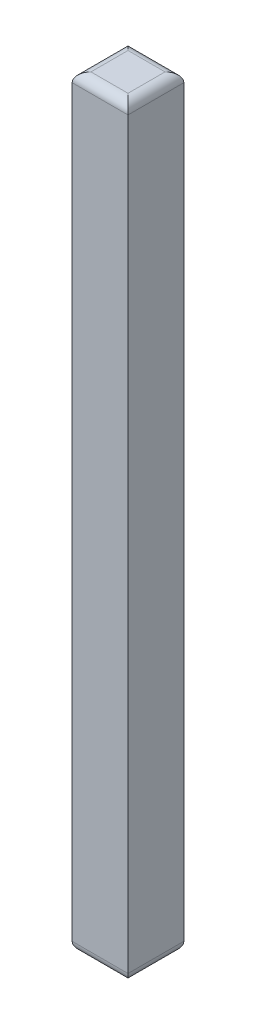
ISO-10303-21;
HEADER;
FILE_DESCRIPTION(('STEP AP214'),'2;1');
FILE_NAME('part.step','',(''),(''),'','','');
FILE_SCHEMA(('AUTOMOTIVE_DESIGN { 1 0 10303 214 1 1 1 1 }'));
ENDSEC;
DATA;
#1=APPLICATION_CONTEXT('core data for automotive mechanical design processes');
#2=APPLICATION_PROTOCOL_DEFINITION('international standard','automotive_design',2000,#1);
#3=PRODUCT_CONTEXT('',#1,'mechanical');
#4=PRODUCT('Part','Part','',(#3));
#5=PRODUCT_RELATED_PRODUCT_CATEGORY('part','',(#4));
#6=PRODUCT_DEFINITION_FORMATION('','',#4);
#7=PRODUCT_DEFINITION_CONTEXT('part definition',#1,'design');
#8=PRODUCT_DEFINITION('design','',#6,#7);
#9=PRODUCT_DEFINITION_SHAPE('','',#8);
#10=(LENGTH_UNIT() NAMED_UNIT(*) SI_UNIT(.MILLI.,.METRE.));
#11=(NAMED_UNIT(*) PLANE_ANGLE_UNIT() SI_UNIT($,.RADIAN.));
#12=(NAMED_UNIT(*) SI_UNIT($,.STERADIAN.) SOLID_ANGLE_UNIT());
#13=UNCERTAINTY_MEASURE_WITH_UNIT(LENGTH_MEASURE(1.E-05),#10,'distance_accuracy_value','');
#14=(GEOMETRIC_REPRESENTATION_CONTEXT(3) GLOBAL_UNCERTAINTY_ASSIGNED_CONTEXT((#13)) GLOBAL_UNIT_ASSIGNED_CONTEXT((#10,
#11,#12)) REPRESENTATION_CONTEXT('',''));
#15=CARTESIAN_POINT('',(0.,0.,0.));
#16=DIRECTION('',(0.,0.,1.));
#17=DIRECTION('',(1.,0.,0.));
#18=AXIS2_PLACEMENT_3D('',#15,#16,#17);
#19=CARTESIAN_POINT('',(0.,41.275,0.));
#20=DIRECTION('',(1.,0.,0.));
#21=DIRECTION('',(0.,0.,-1.));
#22=AXIS2_PLACEMENT_3D('',#19,#20,#21);
#23=PLANE('',#22);
#24=DIRECTION('',(0.,-1.,0.));
#25=VECTOR('',#24,1.);
#26=CARTESIAN_POINT('',(0.,41.275,0.));
#27=LINE('',#26,#25);
#28=CARTESIAN_POINT('',(0.,40.767,0.));
#29=VERTEX_POINT('',#28);
#30=CARTESIAN_POINT('',(0.,0.508000000000002,0.));
#31=VERTEX_POINT('',#30);
#32=EDGE_CURVE('E118',#29,#31,#27,.T.);
#33=ORIENTED_EDGE('',*,*,#32,.F.);
#34=DIRECTION('',(0.,0.,1.));
#35=VECTOR('',#34,1.);
#36=CARTESIAN_POINT('',(0.,40.767,0.));
#37=LINE('',#36,#35);
#38=CARTESIAN_POINT('',(0.,40.767,-3.0226));
#39=VERTEX_POINT('',#38);
#40=EDGE_CURVE('E142',#29,#39,#37,.F.);
#41=ORIENTED_EDGE('',*,*,#40,.T.);
#42=DIRECTION('',(0.,-1.,0.));
#43=VECTOR('',#42,1.);
#44=CARTESIAN_POINT('',(0.,41.275,-3.0226));
#45=LINE('',#44,#43);
#46=CARTESIAN_POINT('',(0.,0.508000000000002,-3.0226));
#47=VERTEX_POINT('',#46);
#48=EDGE_CURVE('E153',#39,#47,#45,.T.);
#49=ORIENTED_EDGE('',*,*,#48,.T.);
#50=DIRECTION('',(0.,0.,1.));
#51=VECTOR('',#50,1.);
#52=CARTESIAN_POINT('',(0.,0.508000000000002,0.));
#53=LINE('',#52,#51);
#54=EDGE_CURVE('E140',#47,#31,#53,.T.);
#55=ORIENTED_EDGE('',*,*,#54,.T.);
#56=EDGE_LOOP('',(#33,#41,#49,#55));
#57=FACE_BOUND('',#56,.T.);
#58=ADVANCED_FACE('F33',(#57),#23,.F.);
#59=CARTESIAN_POINT('',(0.,41.275,0.));
#60=DIRECTION('',(0.,0.,-1.));
#61=DIRECTION('',(-1.,0.,0.));
#62=AXIS2_PLACEMENT_3D('',#59,#60,#61);
#63=PLANE('',#62);
#64=DIRECTION('',(0.,-1.,0.));
#65=VECTOR('',#64,1.);
#66=CARTESIAN_POINT('',(3.0226,41.275,0.));
#67=LINE('',#66,#65);
#68=CARTESIAN_POINT('',(3.0226,40.767,0.));
#69=VERTEX_POINT('',#68);
#70=CARTESIAN_POINT('',(3.0226,0.508000000000002,0.));
#71=VERTEX_POINT('',#70);
#72=EDGE_CURVE('E278',#69,#71,#67,.T.);
#73=ORIENTED_EDGE('',*,*,#72,.F.);
#74=DIRECTION('',(1.,0.,0.));
#75=VECTOR('',#74,1.);
#76=CARTESIAN_POINT('',(0.,40.767,0.));
#77=LINE('',#76,#75);
#78=EDGE_CURVE('E138',#69,#29,#77,.F.);
#79=ORIENTED_EDGE('',*,*,#78,.T.);
#80=ORIENTED_EDGE('',*,*,#32,.T.);
#81=DIRECTION('',(1.,0.,0.));
#82=VECTOR('',#81,1.);
#83=CARTESIAN_POINT('',(3.0226,0.508000000000002,0.));
#84=LINE('',#83,#82);
#85=EDGE_CURVE('E135',#31,#71,#84,.T.);
#86=ORIENTED_EDGE('',*,*,#85,.T.);
#87=EDGE_LOOP('',(#73,#79,#80,#86));
#88=FACE_BOUND('',#87,.T.);
#89=ADVANCED_FACE('F191',(#88),#63,.F.);
#90=CARTESIAN_POINT('',(3.0226,41.275,0.));
#91=DIRECTION('',(-1.,0.,0.));
#92=DIRECTION('',(0.,0.,1.));
#93=AXIS2_PLACEMENT_3D('',#90,#91,#92);
#94=PLANE('',#93);
#95=DIRECTION('',(0.,-1.,0.));
#96=VECTOR('',#95,1.);
#97=CARTESIAN_POINT('',(3.0226,41.275,-3.0226));
#98=LINE('',#97,#96);
#99=CARTESIAN_POINT('',(3.0226,40.767,-3.0226));
#100=VERTEX_POINT('',#99);
#101=CARTESIAN_POINT('',(3.0226,0.508000000000002,-3.0226));
#102=VERTEX_POINT('',#101);
#103=EDGE_CURVE('E274',#100,#102,#98,.T.);
#104=ORIENTED_EDGE('',*,*,#103,.F.);
#105=DIRECTION('',(0.,0.,-1.));
#106=VECTOR('',#105,1.);
#107=CARTESIAN_POINT('',(3.0226,40.767,0.));
#108=LINE('',#107,#106);
#109=EDGE_CURVE('E133',#100,#69,#108,.F.);
#110=ORIENTED_EDGE('',*,*,#109,.T.);
#111=ORIENTED_EDGE('',*,*,#72,.T.);
#112=DIRECTION('',(0.,0.,-1.));
#113=VECTOR('',#112,1.);
#114=CARTESIAN_POINT('',(3.0226,0.508000000000002,-3.0226));
#115=LINE('',#114,#113);
#116=EDGE_CURVE('E131',#71,#102,#115,.T.);
#117=ORIENTED_EDGE('',*,*,#116,.T.);
#118=EDGE_LOOP('',(#104,#110,#111,#117));
#119=FACE_BOUND('',#118,.T.);
#120=ADVANCED_FACE('F197',(#119),#94,.F.);
#121=CARTESIAN_POINT('',(0.,41.275,-3.0226));
#122=DIRECTION('',(0.,0.,1.));
#123=DIRECTION('',(1.,0.,0.));
#124=AXIS2_PLACEMENT_3D('',#121,#122,#123);
#125=PLANE('',#124);
#126=ORIENTED_EDGE('',*,*,#48,.F.);
#127=DIRECTION('',(-1.,0.,0.));
#128=VECTOR('',#127,1.);
#129=CARTESIAN_POINT('',(0.,40.767,-3.0226));
#130=LINE('',#129,#128);
#131=EDGE_CURVE('E105',#39,#100,#130,.F.);
#132=ORIENTED_EDGE('',*,*,#131,.T.);
#133=ORIENTED_EDGE('',*,*,#103,.T.);
#134=DIRECTION('',(-1.,0.,0.));
#135=VECTOR('',#134,1.);
#136=CARTESIAN_POINT('',(0.,0.508000000000002,-3.0226));
#137=LINE('',#136,#135);
#138=EDGE_CURVE('E124',#102,#47,#137,.T.);
#139=ORIENTED_EDGE('',*,*,#138,.T.);
#140=EDGE_LOOP('',(#126,#132,#133,#139));
#141=FACE_BOUND('',#140,.T.);
#142=ADVANCED_FACE('F187',(#141),#125,.F.);
#143=CARTESIAN_POINT('',(0.,41.275,0.));
#144=DIRECTION('',(0.,-1.,0.));
#145=DIRECTION('',(0.,0.,-1.));
#146=AXIS2_PLACEMENT_3D('',#143,#144,#145);
#147=PLANE('',#146);
#148=DIRECTION('',(0.,0.,-1.));
#149=VECTOR('',#148,1.);
#150=CARTESIAN_POINT('',(2.5146,41.275,0.));
#151=LINE('',#150,#149);
#152=CARTESIAN_POINT('',(2.5146,41.275,-0.508));
#153=VERTEX_POINT('',#152);
#154=CARTESIAN_POINT('',(2.5146,41.275,-2.5146));
#155=VERTEX_POINT('',#154);
#156=EDGE_CURVE('E122',#153,#155,#151,.T.);
#157=ORIENTED_EDGE('',*,*,#156,.T.);
#158=DIRECTION('',(-1.,0.,0.));
#159=VECTOR('',#158,1.);
#160=CARTESIAN_POINT('',(0.,41.275,-2.5146));
#161=LINE('',#160,#159);
#162=CARTESIAN_POINT('',(0.508,41.275,-2.5146));
#163=VERTEX_POINT('',#162);
#164=EDGE_CURVE('E103',#155,#163,#161,.T.);
#165=ORIENTED_EDGE('',*,*,#164,.T.);
#166=DIRECTION('',(0.,0.,1.));
#167=VECTOR('',#166,1.);
#168=CARTESIAN_POINT('',(0.508,41.275,0.));
#169=LINE('',#168,#167);
#170=CARTESIAN_POINT('',(0.508,41.275,-0.508));
#171=VERTEX_POINT('',#170);
#172=EDGE_CURVE('E111',#163,#171,#169,.T.);
#173=ORIENTED_EDGE('',*,*,#172,.T.);
#174=DIRECTION('',(1.,0.,0.));
#175=VECTOR('',#174,1.);
#176=CARTESIAN_POINT('',(0.,41.275,-0.508));
#177=LINE('',#176,#175);
#178=EDGE_CURVE('E117',#171,#153,#177,.T.);
#179=ORIENTED_EDGE('',*,*,#178,.T.);
#180=EDGE_LOOP('',(#157,#165,#173,#179));
#181=FACE_BOUND('',#180,.T.);
#182=ADVANCED_FACE('F120',(#181),#147,.F.);
#183=CARTESIAN_POINT('',(0.,0.,0.));
#184=DIRECTION('',(0.,-1.,0.));
#185=DIRECTION('',(0.,0.,-1.));
#186=AXIS2_PLACEMENT_3D('',#183,#184,#185);
#187=PLANE('',#186);
#188=DIRECTION('',(0.,0.,-1.));
#189=VECTOR('',#188,1.);
#190=CARTESIAN_POINT('',(2.5146,0.,0.));
#191=LINE('',#190,#189);
#192=CARTESIAN_POINT('',(2.5146,0.,-2.5146));
#193=VERTEX_POINT('',#192);
#194=CARTESIAN_POINT('',(2.5146,0.,-0.508));
#195=VERTEX_POINT('',#194);
#196=EDGE_CURVE('E42',#193,#195,#191,.F.);
#197=ORIENTED_EDGE('',*,*,#196,.T.);
#198=DIRECTION('',(1.,0.,0.));
#199=VECTOR('',#198,1.);
#200=CARTESIAN_POINT('',(0.,0.,-0.508));
#201=LINE('',#200,#199);
#202=CARTESIAN_POINT('',(0.508,0.,-0.508));
#203=VERTEX_POINT('',#202);
#204=EDGE_CURVE('E11',#195,#203,#201,.F.);
#205=ORIENTED_EDGE('',*,*,#204,.T.);
#206=DIRECTION('',(0.,0.,1.));
#207=VECTOR('',#206,1.);
#208=CARTESIAN_POINT('',(0.508,0.,-3.0226));
#209=LINE('',#208,#207);
#210=CARTESIAN_POINT('',(0.508,0.,-2.5146));
#211=VERTEX_POINT('',#210);
#212=EDGE_CURVE('E144',#203,#211,#209,.F.);
#213=ORIENTED_EDGE('',*,*,#212,.T.);
#214=DIRECTION('',(-1.,0.,0.));
#215=VECTOR('',#214,1.);
#216=CARTESIAN_POINT('',(3.0226,0.,-2.5146));
#217=LINE('',#216,#215);
#218=EDGE_CURVE('E53',#211,#193,#217,.F.);
#219=ORIENTED_EDGE('',*,*,#218,.T.);
#220=EDGE_LOOP('',(#197,#205,#213,#219));
#221=FACE_BOUND('',#220,.T.);
#222=ADVANCED_FACE('F175',(#221),#187,.T.);
#223=CARTESIAN_POINT('',(0.,40.767,-0.508));
#224=DIRECTION('',(1.,0.,0.));
#225=DIRECTION('',(0.,0.,-1.));
#226=AXIS2_PLACEMENT_3D('',#223,#224,#225);
#227=CYLINDRICAL_SURFACE('',#226,0.508);
#228=CARTESIAN_POINT('',(0.508,40.767,-0.508));
#229=DIRECTION('',(0.707106781186547,0.,0.707106781186547));
#230=DIRECTION('',(-0.707106781186547,0.,0.707106781186547));
#231=AXIS2_PLACEMENT_3D('',#228,#229,#230);
#232=ELLIPSE('',#231,0.718420489685532,0.508);
#233=EDGE_CURVE('E114',#29,#171,#232,.F.);
#234=ORIENTED_EDGE('',*,*,#233,.F.);
#235=ORIENTED_EDGE('',*,*,#78,.F.);
#236=CARTESIAN_POINT('',(2.5146,40.767,-0.508));
#237=DIRECTION('',(0.707106781186547,0.,-0.707106781186548));
#238=DIRECTION('',(0.707106781186548,0.,0.707106781186547));
#239=AXIS2_PLACEMENT_3D('',#236,#237,#238);
#240=ELLIPSE('',#239,0.718420489685532,0.508);
#241=EDGE_CURVE('E150',#153,#69,#240,.T.);
#242=ORIENTED_EDGE('',*,*,#241,.F.);
#243=ORIENTED_EDGE('',*,*,#178,.F.);
#244=EDGE_LOOP('',(#234,#235,#242,#243));
#245=FACE_BOUND('',#244,.T.);
#246=ADVANCED_FACE('F177',(#245),#227,.T.);
#247=CARTESIAN_POINT('',(2.5146,40.767,0.));
#248=DIRECTION('',(0.,0.,-1.));
#249=DIRECTION('',(-1.,0.,0.));
#250=AXIS2_PLACEMENT_3D('',#247,#248,#249);
#251=CYLINDRICAL_SURFACE('',#250,0.508);
#252=ORIENTED_EDGE('',*,*,#241,.T.);
#253=ORIENTED_EDGE('',*,*,#109,.F.);
#254=CARTESIAN_POINT('',(2.5146,40.767,-2.5146));
#255=DIRECTION('',(-0.707106781186548,0.,-0.707106781186547));
#256=DIRECTION('',(0.707106781186547,0.,-0.707106781186548));
#257=AXIS2_PLACEMENT_3D('',#254,#255,#256);
#258=ELLIPSE('',#257,0.718420489685532,0.508);
#259=EDGE_CURVE('E108',#155,#100,#258,.T.);
#260=ORIENTED_EDGE('',*,*,#259,.F.);
#261=ORIENTED_EDGE('',*,*,#156,.F.);
#262=EDGE_LOOP('',(#252,#253,#260,#261));
#263=FACE_BOUND('',#262,.T.);
#264=ADVANCED_FACE('F184',(#263),#251,.T.);
#265=CARTESIAN_POINT('',(0.508,40.767,0.));
#266=DIRECTION('',(0.,0.,1.));
#267=DIRECTION('',(1.,0.,0.));
#268=AXIS2_PLACEMENT_3D('',#265,#266,#267);
#269=CYLINDRICAL_SURFACE('',#268,0.508);
#270=ORIENTED_EDGE('',*,*,#233,.T.);
#271=ORIENTED_EDGE('',*,*,#172,.F.);
#272=CARTESIAN_POINT('',(0.508,40.767,-2.5146));
#273=DIRECTION('',(-0.707106781186547,0.,0.707106781186547));
#274=DIRECTION('',(0.707106781186547,0.,0.707106781186547));
#275=AXIS2_PLACEMENT_3D('',#272,#273,#274);
#276=ELLIPSE('',#275,0.718420489685532,0.508);
#277=EDGE_CURVE('E99',#39,#163,#276,.F.);
#278=ORIENTED_EDGE('',*,*,#277,.F.);
#279=ORIENTED_EDGE('',*,*,#40,.F.);
#280=EDGE_LOOP('',(#270,#271,#278,#279));
#281=FACE_BOUND('',#280,.T.);
#282=ADVANCED_FACE('F112',(#281),#269,.T.);
#283=CARTESIAN_POINT('',(0.,40.767,-2.5146));
#284=DIRECTION('',(-1.,0.,0.));
#285=DIRECTION('',(0.,0.,1.));
#286=AXIS2_PLACEMENT_3D('',#283,#284,#285);
#287=CYLINDRICAL_SURFACE('',#286,0.508);
#288=ORIENTED_EDGE('',*,*,#259,.T.);
#289=ORIENTED_EDGE('',*,*,#131,.F.);
#290=ORIENTED_EDGE('',*,*,#277,.T.);
#291=ORIENTED_EDGE('',*,*,#164,.F.);
#292=EDGE_LOOP('',(#288,#289,#290,#291));
#293=FACE_BOUND('',#292,.T.);
#294=ADVANCED_FACE('F101',(#293),#287,.T.);
#295=CARTESIAN_POINT('',(0.,0.508000000000002,-2.5146));
#296=DIRECTION('',(1.,0.,0.));
#297=DIRECTION('',(0.,0.,-1.));
#298=AXIS2_PLACEMENT_3D('',#295,#296,#297);
#299=CYLINDRICAL_SURFACE('',#298,0.508);
#300=CARTESIAN_POINT('',(2.5146,0.508000000000002,-2.5146));
#301=DIRECTION('',(0.707106781186548,0.,0.707106781186547));
#302=DIRECTION('',(0.707106781186547,0.,-0.707106781186548));
#303=AXIS2_PLACEMENT_3D('',#300,#301,#302);
#304=ELLIPSE('',#303,0.718420489685532,0.508);
#305=EDGE_CURVE('E157',#193,#102,#304,.T.);
#306=ORIENTED_EDGE('',*,*,#305,.F.);
#307=ORIENTED_EDGE('',*,*,#218,.F.);
#308=CARTESIAN_POINT('',(0.508,0.508000000000002,-2.5146));
#309=DIRECTION('',(0.707106781186547,0.,-0.707106781186547));
#310=DIRECTION('',(-0.707106781186547,0.,-0.707106781186547));
#311=AXIS2_PLACEMENT_3D('',#308,#309,#310);
#312=ELLIPSE('',#311,0.718420489685532,0.508);
#313=EDGE_CURVE('E37',#47,#211,#312,.F.);
#314=ORIENTED_EDGE('',*,*,#313,.F.);
#315=ORIENTED_EDGE('',*,*,#138,.F.);
#316=EDGE_LOOP('',(#306,#307,#314,#315));
#317=FACE_BOUND('',#316,.T.);
#318=ADVANCED_FACE('F35',(#317),#299,.T.);
#319=CARTESIAN_POINT('',(0.508,0.508000000000002,0.));
#320=DIRECTION('',(0.,0.,-1.));
#321=DIRECTION('',(-1.,0.,0.));
#322=AXIS2_PLACEMENT_3D('',#319,#320,#321);
#323=CYLINDRICAL_SURFACE('',#322,0.508);
#324=ORIENTED_EDGE('',*,*,#313,.T.);
#325=ORIENTED_EDGE('',*,*,#212,.F.);
#326=CARTESIAN_POINT('',(0.508,0.508000000000002,-0.508));
#327=DIRECTION('',(-0.707106781186547,0.,-0.707106781186547));
#328=DIRECTION('',(0.707106781186547,0.,-0.707106781186547));
#329=AXIS2_PLACEMENT_3D('',#326,#327,#328);
#330=ELLIPSE('',#329,0.718420489685532,0.508);
#331=EDGE_CURVE('E156',#31,#203,#330,.F.);
#332=ORIENTED_EDGE('',*,*,#331,.F.);
#333=ORIENTED_EDGE('',*,*,#54,.F.);
#334=EDGE_LOOP('',(#324,#325,#332,#333));
#335=FACE_BOUND('',#334,.T.);
#336=ADVANCED_FACE('F166',(#335),#323,.T.);
#337=CARTESIAN_POINT('',(2.5146,0.508000000000002,0.));
#338=DIRECTION('',(0.,0.,1.));
#339=DIRECTION('',(1.,0.,0.));
#340=AXIS2_PLACEMENT_3D('',#337,#338,#339);
#341=CYLINDRICAL_SURFACE('',#340,0.508);
#342=ORIENTED_EDGE('',*,*,#305,.T.);
#343=ORIENTED_EDGE('',*,*,#116,.F.);
#344=CARTESIAN_POINT('',(2.5146,0.508000000000002,-0.508));
#345=DIRECTION('',(-0.707106781186547,0.,0.707106781186548));
#346=DIRECTION('',(0.707106781186548,0.,0.707106781186547));
#347=AXIS2_PLACEMENT_3D('',#344,#345,#346);
#348=ELLIPSE('',#347,0.718420489685532,0.508);
#349=EDGE_CURVE('E154',#195,#71,#348,.T.);
#350=ORIENTED_EDGE('',*,*,#349,.F.);
#351=ORIENTED_EDGE('',*,*,#196,.F.);
#352=EDGE_LOOP('',(#342,#343,#350,#351));
#353=FACE_BOUND('',#352,.T.);
#354=ADVANCED_FACE('F171',(#353),#341,.T.);
#355=CARTESIAN_POINT('',(0.,0.508000000000002,-0.508));
#356=DIRECTION('',(-1.,0.,0.));
#357=DIRECTION('',(0.,0.,1.));
#358=AXIS2_PLACEMENT_3D('',#355,#356,#357);
#359=CYLINDRICAL_SURFACE('',#358,0.508);
#360=ORIENTED_EDGE('',*,*,#331,.T.);
#361=ORIENTED_EDGE('',*,*,#204,.F.);
#362=ORIENTED_EDGE('',*,*,#349,.T.);
#363=ORIENTED_EDGE('',*,*,#85,.F.);
#364=EDGE_LOOP('',(#360,#361,#362,#363));
#365=FACE_BOUND('',#364,.T.);
#366=ADVANCED_FACE('F174',(#365),#359,.T.);
#367=CLOSED_SHELL('',(#58,#89,#120,#142,#182,#222,#246,#264,#282,#294,#318,#336,#354,#366));
#368=MANIFOLD_SOLID_BREP('B2',#367);
#369=ADVANCED_BREP_SHAPE_REPRESENTATION('',(#18,#368),#14);
#370=SHAPE_DEFINITION_REPRESENTATION(#9,#369);
ENDSEC;
END-ISO-10303-21;
